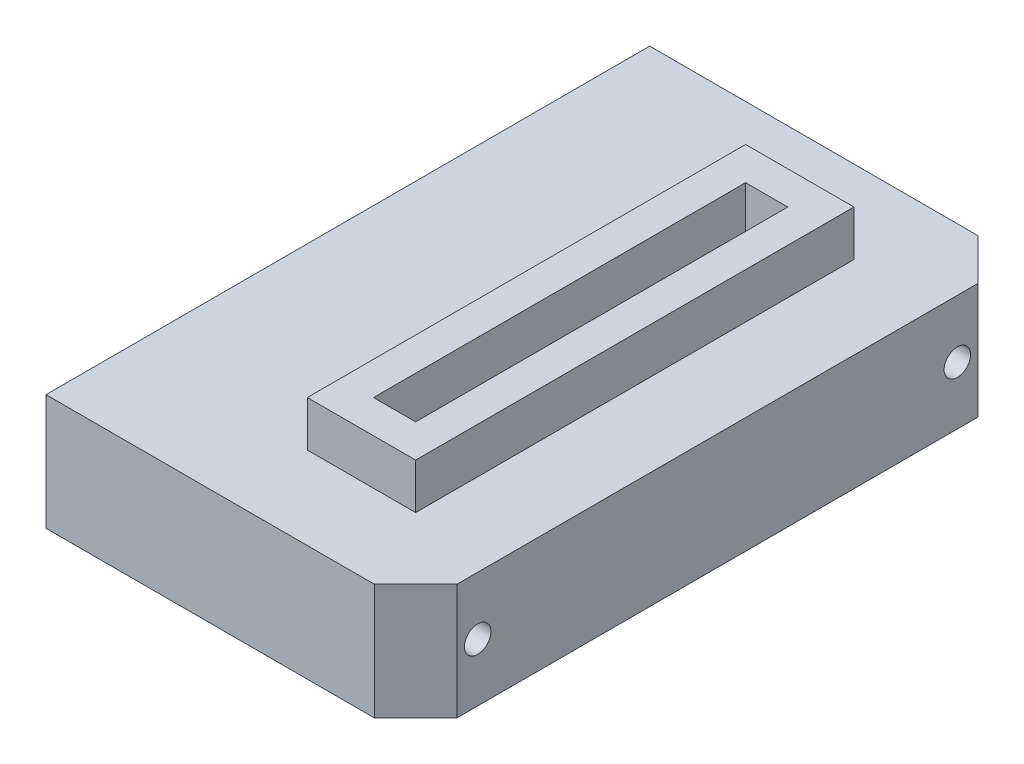
ISO-10303-21;
HEADER;
FILE_DESCRIPTION(('STEP AP214'),'2;1');
FILE_NAME('part.step','',(''),(''),'','','');
FILE_SCHEMA(('AUTOMOTIVE_DESIGN { 1 0 10303 214 1 1 1 1 }'));
ENDSEC;
DATA;
#1=APPLICATION_CONTEXT('core data for automotive mechanical design processes');
#2=APPLICATION_PROTOCOL_DEFINITION('international standard','automotive_design',2000,#1);
#3=PRODUCT_CONTEXT('',#1,'mechanical');
#4=PRODUCT('Part','Part','',(#3));
#5=PRODUCT_RELATED_PRODUCT_CATEGORY('part','',(#4));
#6=PRODUCT_DEFINITION_FORMATION('','',#4);
#7=PRODUCT_DEFINITION_CONTEXT('part definition',#1,'design');
#8=PRODUCT_DEFINITION('design','',#6,#7);
#9=PRODUCT_DEFINITION_SHAPE('','',#8);
#10=(LENGTH_UNIT() NAMED_UNIT(*) SI_UNIT(.MILLI.,.METRE.));
#11=(NAMED_UNIT(*) PLANE_ANGLE_UNIT() SI_UNIT($,.RADIAN.));
#12=(NAMED_UNIT(*) SI_UNIT($,.STERADIAN.) SOLID_ANGLE_UNIT());
#13=UNCERTAINTY_MEASURE_WITH_UNIT(LENGTH_MEASURE(1.E-05),#10,'distance_accuracy_value','');
#14=(GEOMETRIC_REPRESENTATION_CONTEXT(3) GLOBAL_UNCERTAINTY_ASSIGNED_CONTEXT((#13)) GLOBAL_UNIT_ASSIGNED_CONTEXT((#10,
#11,#12)) REPRESENTATION_CONTEXT('',''));
#15=CARTESIAN_POINT('',(0.,0.,0.));
#16=DIRECTION('',(0.,0.,1.));
#17=DIRECTION('',(1.,0.,0.));
#18=AXIS2_PLACEMENT_3D('',#15,#16,#17);
#19=CARTESIAN_POINT('',(0.,14.,0.));
#20=DIRECTION('',(0.,1.,0.));
#21=DIRECTION('',(0.,0.,1.));
#22=AXIS2_PLACEMENT_3D('',#19,#20,#21);
#23=PLANE('',#22);
#24=DIRECTION('',(0.707106781186548,0.,0.707106781186548));
#25=VECTOR('',#24,1.);
#26=CARTESIAN_POINT('',(17.6340668006405,14.,-27.9603055752748));
#27=LINE('',#26,#25);
#28=CARTESIAN_POINT('',(17.6340668006405,14.,-27.9603055752748));
#29=VERTEX_POINT('',#28);
#30=CARTESIAN_POINT('',(22.6340668006405,14.,-22.9603055752748));
#31=VERTEX_POINT('',#30);
#32=EDGE_CURVE('E139',#29,#31,#27,.T.);
#33=ORIENTED_EDGE('',*,*,#32,.F.);
#34=DIRECTION('',(-1.,0.,0.));
#35=VECTOR('',#34,1.);
#36=CARTESIAN_POINT('',(-22.0659331993595,14.,-27.9603055752748));
#37=LINE('',#36,#35);
#38=CARTESIAN_POINT('',(-22.0659331993595,14.,-27.9603055752748));
#39=VERTEX_POINT('',#38);
#40=EDGE_CURVE('E150',#29,#39,#37,.T.);
#41=ORIENTED_EDGE('',*,*,#40,.T.);
#42=DIRECTION('',(0.,0.,1.));
#43=VECTOR('',#42,1.);
#44=CARTESIAN_POINT('',(-22.0659331993595,14.,-27.9603055752748));
#45=LINE('',#44,#43);
#46=CARTESIAN_POINT('',(-22.0659331993595,14.,45.0396944247252));
#47=VERTEX_POINT('',#46);
#48=EDGE_CURVE('E175',#39,#47,#45,.T.);
#49=ORIENTED_EDGE('',*,*,#48,.T.);
#50=DIRECTION('',(1.,0.,0.));
#51=VECTOR('',#50,1.);
#52=CARTESIAN_POINT('',(-22.0659331993595,14.,45.0396944247252));
#53=LINE('',#52,#51);
#54=CARTESIAN_POINT('',(17.6340668006405,14.,45.0396944247252));
#55=VERTEX_POINT('',#54);
#56=EDGE_CURVE('E160',#47,#55,#53,.T.);
#57=ORIENTED_EDGE('',*,*,#56,.T.);
#58=DIRECTION('',(-0.707106781186548,0.,0.707106781186546));
#59=VECTOR('',#58,1.);
#60=CARTESIAN_POINT('',(17.6340668006405,14.,45.0396944247252));
#61=LINE('',#60,#59);
#62=CARTESIAN_POINT('',(22.6340668006405,14.,40.0396944247252));
#63=VERTEX_POINT('',#62);
#64=EDGE_CURVE('E258',#63,#55,#61,.T.);
#65=ORIENTED_EDGE('',*,*,#64,.F.);
#66=DIRECTION('',(0.,0.,-1.));
#67=VECTOR('',#66,1.);
#68=CARTESIAN_POINT('',(22.6340668006405,14.,-27.9603055752748));
#69=LINE('',#68,#67);
#70=EDGE_CURVE('E154',#63,#31,#69,.T.);
#71=ORIENTED_EDGE('',*,*,#70,.T.);
#72=EDGE_LOOP('',(#33,#41,#49,#57,#65,#71));
#73=FACE_BOUND('',#72,.T.);
#74=DIRECTION('',(1.,0.,0.));
#75=VECTOR('',#74,1.);
#76=CARTESIAN_POINT('',(-0.465933199359521,14.,35.0396944247252));
#77=LINE('',#76,#75);
#78=CARTESIAN_POINT('',(-0.465933199359521,14.,35.0396944247252));
#79=VERTEX_POINT('',#78);
#80=CARTESIAN_POINT('',(12.6340668006405,14.,35.0396944247252));
#81=VERTEX_POINT('',#80);
#82=EDGE_CURVE('E230',#79,#81,#77,.T.);
#83=ORIENTED_EDGE('',*,*,#82,.F.);
#84=DIRECTION('',(0.,0.,1.));
#85=VECTOR('',#84,1.);
#86=CARTESIAN_POINT('',(-0.465933199359527,14.,-17.9603055752748));
#87=LINE('',#86,#85);
#88=CARTESIAN_POINT('',(-0.465933199359527,14.,-17.9603055752748));
#89=VERTEX_POINT('',#88);
#90=EDGE_CURVE('E232',#89,#79,#87,.T.);
#91=ORIENTED_EDGE('',*,*,#90,.F.);
#92=DIRECTION('',(-1.,0.,0.));
#93=VECTOR('',#92,1.);
#94=CARTESIAN_POINT('',(-0.465933199359527,14.,-17.9603055752748));
#95=LINE('',#94,#93);
#96=CARTESIAN_POINT('',(12.6340668006405,14.,-17.9603055752748));
#97=VERTEX_POINT('',#96);
#98=EDGE_CURVE('E224',#97,#89,#95,.T.);
#99=ORIENTED_EDGE('',*,*,#98,.F.);
#100=DIRECTION('',(0.,0.,-1.));
#101=VECTOR('',#100,1.);
#102=CARTESIAN_POINT('',(12.6340668006405,14.,-17.9603055752748));
#103=LINE('',#102,#101);
#104=EDGE_CURVE('E227',#81,#97,#103,.T.);
#105=ORIENTED_EDGE('',*,*,#104,.F.);
#106=EDGE_LOOP('',(#83,#91,#99,#105));
#107=FACE_BOUND('',#106,.T.);
#108=ADVANCED_FACE('F38',(#73,#107),#23,.T.);
#109=CARTESIAN_POINT('',(0.,0.,0.));
#110=DIRECTION('',(0.,1.,0.));
#111=DIRECTION('',(0.,0.,1.));
#112=AXIS2_PLACEMENT_3D('',#109,#110,#111);
#113=PLANE('',#112);
#114=DIRECTION('',(-1.,0.,0.));
#115=VECTOR('',#114,1.);
#116=CARTESIAN_POINT('',(-22.0659331993595,0.,-27.9603055752748));
#117=LINE('',#116,#115);
#118=CARTESIAN_POINT('',(17.6340668006404,0.,-27.9603055752748));
#119=VERTEX_POINT('',#118);
#120=CARTESIAN_POINT('',(-22.0659331993595,0.,-27.9603055752748));
#121=VERTEX_POINT('',#120);
#122=EDGE_CURVE('E174',#119,#121,#117,.T.);
#123=ORIENTED_EDGE('',*,*,#122,.F.);
#124=DIRECTION('',(-0.707106781186548,0.,-0.707106781186548));
#125=VECTOR('',#124,1.);
#126=CARTESIAN_POINT('',(17.6340668006405,0.,-27.9603055752748));
#127=LINE('',#126,#125);
#128=CARTESIAN_POINT('',(22.6340668006405,0.,-22.9603055752748));
#129=VERTEX_POINT('',#128);
#130=EDGE_CURVE('E61',#129,#119,#127,.T.);
#131=ORIENTED_EDGE('',*,*,#130,.F.);
#132=DIRECTION('',(0.,0.,-1.));
#133=VECTOR('',#132,1.);
#134=CARTESIAN_POINT('',(22.6340668006405,0.,-27.9603055752748));
#135=LINE('',#134,#133);
#136=CARTESIAN_POINT('',(22.6340668006405,0.,40.0396944247252));
#137=VERTEX_POINT('',#136);
#138=EDGE_CURVE('E171',#137,#129,#135,.T.);
#139=ORIENTED_EDGE('',*,*,#138,.F.);
#140=DIRECTION('',(0.707106781186549,0.,-0.707106781186547));
#141=VECTOR('',#140,1.);
#142=CARTESIAN_POINT('',(17.6340668006405,0.,45.0396944247252));
#143=LINE('',#142,#141);
#144=CARTESIAN_POINT('',(17.6340668006405,0.,45.0396944247252));
#145=VERTEX_POINT('',#144);
#146=EDGE_CURVE('E53',#145,#137,#143,.T.);
#147=ORIENTED_EDGE('',*,*,#146,.F.);
#148=DIRECTION('',(1.,0.,0.));
#149=VECTOR('',#148,1.);
#150=CARTESIAN_POINT('',(-22.0659331993595,0.,45.0396944247252));
#151=LINE('',#150,#149);
#152=CARTESIAN_POINT('',(-22.0659331993595,0.,45.0396944247252));
#153=VERTEX_POINT('',#152);
#154=EDGE_CURVE('E167',#153,#145,#151,.T.);
#155=ORIENTED_EDGE('',*,*,#154,.F.);
#156=DIRECTION('',(0.,0.,1.));
#157=VECTOR('',#156,1.);
#158=CARTESIAN_POINT('',(-22.0659331993595,0.,-27.9603055752748));
#159=LINE('',#158,#157);
#160=EDGE_CURVE('E164',#121,#153,#159,.T.);
#161=ORIENTED_EDGE('',*,*,#160,.F.);
#162=EDGE_LOOP('',(#123,#131,#139,#147,#155,#161));
#163=FACE_BOUND('',#162,.T.);
#164=DIRECTION('',(0.,0.,1.));
#165=VECTOR('',#164,1.);
#166=CARTESIAN_POINT('',(3.53406680064047,0.,-13.9603055752748));
#167=LINE('',#166,#165);
#168=CARTESIAN_POINT('',(3.53406680064047,0.,-13.9603055752748));
#169=VERTEX_POINT('',#168);
#170=CARTESIAN_POINT('',(3.53406680064048,0.,31.0396944247252));
#171=VERTEX_POINT('',#170);
#172=EDGE_CURVE('E198',#169,#171,#167,.T.);
#173=ORIENTED_EDGE('',*,*,#172,.T.);
#174=DIRECTION('',(1.,0.,0.));
#175=VECTOR('',#174,1.);
#176=CARTESIAN_POINT('',(3.53406680064048,0.,31.0396944247252));
#177=LINE('',#176,#175);
#178=CARTESIAN_POINT('',(8.63406680064048,0.,31.0396944247252));
#179=VERTEX_POINT('',#178);
#180=EDGE_CURVE('E195',#171,#179,#177,.T.);
#181=ORIENTED_EDGE('',*,*,#180,.T.);
#182=DIRECTION('',(0.,0.,-1.));
#183=VECTOR('',#182,1.);
#184=CARTESIAN_POINT('',(8.63406680064047,0.,-13.9603055752748));
#185=LINE('',#184,#183);
#186=CARTESIAN_POINT('',(8.63406680064047,0.,-13.9603055752748));
#187=VERTEX_POINT('',#186);
#188=EDGE_CURVE('E192',#179,#187,#185,.T.);
#189=ORIENTED_EDGE('',*,*,#188,.T.);
#190=DIRECTION('',(-1.,0.,0.));
#191=VECTOR('',#190,1.);
#192=CARTESIAN_POINT('',(3.53406680064047,0.,-13.9603055752748));
#193=LINE('',#192,#191);
#194=EDGE_CURVE('E189',#187,#169,#193,.T.);
#195=ORIENTED_EDGE('',*,*,#194,.T.);
#196=EDGE_LOOP('',(#173,#181,#189,#195));
#197=FACE_BOUND('',#196,.T.);
#198=ADVANCED_FACE('F267',(#163,#197),#113,.F.);
#199=CARTESIAN_POINT('',(-22.0659331993595,14.,-27.9603055752748));
#200=DIRECTION('',(1.,0.,0.));
#201=DIRECTION('',(0.,0.,-1.));
#202=AXIS2_PLACEMENT_3D('',#199,#200,#201);
#203=PLANE('',#202);
#204=CARTESIAN_POINT('',(-22.0659331993595,7.,37.5396944247252));
#205=DIRECTION('',(1.,0.,0.));
#206=DIRECTION('',(0.,0.,-1.));
#207=AXIS2_PLACEMENT_3D('',#204,#205,#206);
#208=CIRCLE('',#207,1.6);
#209=CARTESIAN_POINT('',(-22.0659331993595,7.,35.9396944247252));
#210=VERTEX_POINT('',#209);
#211=EDGE_CURVE('E201',#210,#210,#208,.F.);
#212=ORIENTED_EDGE('',*,*,#211,.F.);
#213=EDGE_LOOP('',(#212));
#214=FACE_BOUND('',#213,.T.);
#215=CARTESIAN_POINT('',(-22.0659331993595,7.,-20.4603055752748));
#216=DIRECTION('',(1.,0.,0.));
#217=DIRECTION('',(0.,0.,-1.));
#218=AXIS2_PLACEMENT_3D('',#215,#216,#217);
#219=CIRCLE('',#218,1.6);
#220=CARTESIAN_POINT('',(-22.0659331993595,7.,-22.0603055752748));
#221=VERTEX_POINT('',#220);
#222=EDGE_CURVE('E202',#221,#221,#219,.F.);
#223=ORIENTED_EDGE('',*,*,#222,.F.);
#224=EDGE_LOOP('',(#223));
#225=FACE_BOUND('',#224,.T.);
#226=ORIENTED_EDGE('',*,*,#160,.T.);
#227=DIRECTION('',(0.,-1.,0.));
#228=VECTOR('',#227,1.);
#229=CARTESIAN_POINT('',(-22.0659331993595,14.,45.0396944247252));
#230=LINE('',#229,#228);
#231=EDGE_CURVE('E11',#47,#153,#230,.T.);
#232=ORIENTED_EDGE('',*,*,#231,.F.);
#233=ORIENTED_EDGE('',*,*,#48,.F.);
#234=DIRECTION('',(0.,-1.,0.));
#235=VECTOR('',#234,1.);
#236=CARTESIAN_POINT('',(-22.0659331993595,14.,-27.9603055752748));
#237=LINE('',#236,#235);
#238=EDGE_CURVE('E46',#39,#121,#237,.T.);
#239=ORIENTED_EDGE('',*,*,#238,.T.);
#240=EDGE_LOOP('',(#226,#232,#233,#239));
#241=FACE_BOUND('',#240,.T.);
#242=ADVANCED_FACE('F40',(#214,#225,#241),#203,.F.);
#243=CARTESIAN_POINT('',(-22.0659331993595,14.,45.0396944247252));
#244=DIRECTION('',(0.,0.,-1.));
#245=DIRECTION('',(-1.,0.,0.));
#246=AXIS2_PLACEMENT_3D('',#243,#244,#245);
#247=PLANE('',#246);
#248=ORIENTED_EDGE('',*,*,#154,.T.);
#249=DIRECTION('',(0.,1.,0.));
#250=VECTOR('',#249,1.);
#251=CARTESIAN_POINT('',(17.6340668006405,-0.000999999999999265,45.0396944247252));
#252=LINE('',#251,#250);
#253=EDGE_CURVE('E255',#145,#55,#252,.T.);
#254=ORIENTED_EDGE('',*,*,#253,.T.);
#255=ORIENTED_EDGE('',*,*,#56,.F.);
#256=ORIENTED_EDGE('',*,*,#231,.T.);
#257=EDGE_LOOP('',(#248,#254,#255,#256));
#258=FACE_BOUND('',#257,.T.);
#259=ADVANCED_FACE('F272',(#258),#247,.F.);
#260=CARTESIAN_POINT('',(22.6340668006405,14.,-27.9603055752748));
#261=DIRECTION('',(-1.,0.,0.));
#262=DIRECTION('',(0.,0.,1.));
#263=AXIS2_PLACEMENT_3D('',#260,#261,#262);
#264=PLANE('',#263);
#265=CARTESIAN_POINT('',(22.6340668006405,7.,37.5396944247252));
#266=DIRECTION('',(1.,0.,0.));
#267=DIRECTION('',(0.,0.,-1.));
#268=AXIS2_PLACEMENT_3D('',#265,#266,#267);
#269=CIRCLE('',#268,1.6);
#270=CARTESIAN_POINT('',(22.6340668006405,7.,35.9396944247252));
#271=VERTEX_POINT('',#270);
#272=EDGE_CURVE('E205',#271,#271,#269,.T.);
#273=ORIENTED_EDGE('',*,*,#272,.F.);
#274=EDGE_LOOP('',(#273));
#275=FACE_BOUND('',#274,.T.);
#276=CARTESIAN_POINT('',(22.6340668006405,7.,-20.4603055752748));
#277=DIRECTION('',(1.,0.,0.));
#278=DIRECTION('',(0.,0.,-1.));
#279=AXIS2_PLACEMENT_3D('',#276,#277,#278);
#280=CIRCLE('',#279,1.6);
#281=CARTESIAN_POINT('',(22.6340668006405,7.,-22.0603055752748));
#282=VERTEX_POINT('',#281);
#283=EDGE_CURVE('E206',#282,#282,#280,.T.);
#284=ORIENTED_EDGE('',*,*,#283,.F.);
#285=EDGE_LOOP('',(#284));
#286=FACE_BOUND('',#285,.T.);
#287=ORIENTED_EDGE('',*,*,#138,.T.);
#288=DIRECTION('',(0.,1.,0.));
#289=VECTOR('',#288,1.);
#290=CARTESIAN_POINT('',(22.6340668006405,-0.000999999999999265,-22.9603055752748));
#291=LINE('',#290,#289);
#292=EDGE_CURVE('E144',#129,#31,#291,.T.);
#293=ORIENTED_EDGE('',*,*,#292,.T.);
#294=ORIENTED_EDGE('',*,*,#70,.F.);
#295=DIRECTION('',(0.,1.,0.));
#296=VECTOR('',#295,1.);
#297=CARTESIAN_POINT('',(22.6340668006405,-0.000999999999999265,40.0396944247252));
#298=LINE('',#297,#296);
#299=EDGE_CURVE('E256',#137,#63,#298,.T.);
#300=ORIENTED_EDGE('',*,*,#299,.F.);
#301=EDGE_LOOP('',(#287,#293,#294,#300));
#302=FACE_BOUND('',#301,.T.);
#303=ADVANCED_FACE('F264',(#275,#286,#302),#264,.F.);
#304=CARTESIAN_POINT('',(-22.0659331993595,14.,-27.9603055752748));
#305=DIRECTION('',(0.,0.,1.));
#306=DIRECTION('',(1.,0.,0.));
#307=AXIS2_PLACEMENT_3D('',#304,#305,#306);
#308=PLANE('',#307);
#309=ORIENTED_EDGE('',*,*,#40,.F.);
#310=DIRECTION('',(0.,1.,0.));
#311=VECTOR('',#310,1.);
#312=CARTESIAN_POINT('',(17.6340668006405,-0.000999999999999265,-27.9603055752748));
#313=LINE('',#312,#311);
#314=EDGE_CURVE('E136',#119,#29,#313,.T.);
#315=ORIENTED_EDGE('',*,*,#314,.F.);
#316=ORIENTED_EDGE('',*,*,#122,.T.);
#317=ORIENTED_EDGE('',*,*,#238,.F.);
#318=EDGE_LOOP('',(#309,#315,#316,#317));
#319=FACE_BOUND('',#318,.T.);
#320=ADVANCED_FACE('F156',(#319),#308,.F.);
#321=CARTESIAN_POINT('',(3.53406680064047,14.,-13.9603055752748));
#322=DIRECTION('',(1.,0.,0.));
#323=DIRECTION('',(0.,0.,-1.));
#324=AXIS2_PLACEMENT_3D('',#321,#322,#323);
#325=PLANE('',#324);
#326=ORIENTED_EDGE('',*,*,#172,.F.);
#327=DIRECTION('',(0.,-1.,0.));
#328=VECTOR('',#327,1.);
#329=CARTESIAN_POINT('',(3.53406680064047,14.,-13.9603055752748));
#330=LINE('',#329,#328);
#331=CARTESIAN_POINT('',(3.53406680064047,19.5,-13.9603055752748));
#332=VERTEX_POINT('',#331);
#333=EDGE_CURVE('E186',#332,#169,#330,.T.);
#334=ORIENTED_EDGE('',*,*,#333,.F.);
#335=DIRECTION('',(0.,0.,1.));
#336=VECTOR('',#335,1.);
#337=CARTESIAN_POINT('',(3.53406680064047,19.5,-13.9603055752748));
#338=LINE('',#337,#336);
#339=CARTESIAN_POINT('',(3.53406680064047,19.5,31.0396944247252));
#340=VERTEX_POINT('',#339);
#341=EDGE_CURVE('E251',#332,#340,#338,.T.);
#342=ORIENTED_EDGE('',*,*,#341,.T.);
#343=DIRECTION('',(0.,-1.,0.));
#344=VECTOR('',#343,1.);
#345=CARTESIAN_POINT('',(3.53406680064048,14.,31.0396944247252));
#346=LINE('',#345,#344);
#347=EDGE_CURVE('E168',#340,#171,#346,.T.);
#348=ORIENTED_EDGE('',*,*,#347,.T.);
#349=EDGE_LOOP('',(#326,#334,#342,#348));
#350=FACE_BOUND('',#349,.T.);
#351=ADVANCED_FACE('F290',(#350),#325,.T.);
#352=CARTESIAN_POINT('',(3.53406680064048,14.,31.0396944247252));
#353=DIRECTION('',(0.,0.,-1.));
#354=DIRECTION('',(-1.,0.,0.));
#355=AXIS2_PLACEMENT_3D('',#352,#353,#354);
#356=PLANE('',#355);
#357=ORIENTED_EDGE('',*,*,#180,.F.);
#358=ORIENTED_EDGE('',*,*,#347,.F.);
#359=DIRECTION('',(1.,0.,0.));
#360=VECTOR('',#359,1.);
#361=CARTESIAN_POINT('',(3.53406680064047,19.5,31.0396944247252));
#362=LINE('',#361,#360);
#363=CARTESIAN_POINT('',(8.63406680064048,19.5,31.0396944247252));
#364=VERTEX_POINT('',#363);
#365=EDGE_CURVE('E248',#340,#364,#362,.T.);
#366=ORIENTED_EDGE('',*,*,#365,.T.);
#367=DIRECTION('',(0.,-1.,0.));
#368=VECTOR('',#367,1.);
#369=CARTESIAN_POINT('',(8.63406680064048,14.,31.0396944247252));
#370=LINE('',#369,#368);
#371=EDGE_CURVE('E182',#364,#179,#370,.T.);
#372=ORIENTED_EDGE('',*,*,#371,.T.);
#373=EDGE_LOOP('',(#357,#358,#366,#372));
#374=FACE_BOUND('',#373,.T.);
#375=ADVANCED_FACE('F328',(#374),#356,.T.);
#376=CARTESIAN_POINT('',(8.63406680064047,14.,-13.9603055752748));
#377=DIRECTION('',(-1.,0.,0.));
#378=DIRECTION('',(0.,0.,1.));
#379=AXIS2_PLACEMENT_3D('',#376,#377,#378);
#380=PLANE('',#379);
#381=ORIENTED_EDGE('',*,*,#188,.F.);
#382=ORIENTED_EDGE('',*,*,#371,.F.);
#383=DIRECTION('',(0.,0.,-1.));
#384=VECTOR('',#383,1.);
#385=CARTESIAN_POINT('',(8.63406680064048,19.5,-13.9603055752748));
#386=LINE('',#385,#384);
#387=CARTESIAN_POINT('',(8.63406680064048,19.5,-13.9603055752748));
#388=VERTEX_POINT('',#387);
#389=EDGE_CURVE('E245',#364,#388,#386,.T.);
#390=ORIENTED_EDGE('',*,*,#389,.T.);
#391=DIRECTION('',(0.,-1.,0.));
#392=VECTOR('',#391,1.);
#393=CARTESIAN_POINT('',(8.63406680064047,14.,-13.9603055752748));
#394=LINE('',#393,#392);
#395=EDGE_CURVE('E184',#388,#187,#394,.T.);
#396=ORIENTED_EDGE('',*,*,#395,.T.);
#397=EDGE_LOOP('',(#381,#382,#390,#396));
#398=FACE_BOUND('',#397,.T.);
#399=ADVANCED_FACE('F322',(#398),#380,.T.);
#400=CARTESIAN_POINT('',(3.53406680064047,14.,-13.9603055752748));
#401=DIRECTION('',(0.,0.,1.));
#402=DIRECTION('',(1.,0.,0.));
#403=AXIS2_PLACEMENT_3D('',#400,#401,#402);
#404=PLANE('',#403);
#405=ORIENTED_EDGE('',*,*,#194,.F.);
#406=ORIENTED_EDGE('',*,*,#395,.F.);
#407=DIRECTION('',(-1.,0.,0.));
#408=VECTOR('',#407,1.);
#409=CARTESIAN_POINT('',(3.53406680064047,19.5,-13.9603055752748));
#410=LINE('',#409,#408);
#411=EDGE_CURVE('E235',#388,#332,#410,.T.);
#412=ORIENTED_EDGE('',*,*,#411,.T.);
#413=ORIENTED_EDGE('',*,*,#333,.T.);
#414=EDGE_LOOP('',(#405,#406,#412,#413));
#415=FACE_BOUND('',#414,.T.);
#416=ADVANCED_FACE('F312',(#415),#404,.T.);
#417=CARTESIAN_POINT('',(-22.0669331993595,7.,-20.4603055752748));
#418=DIRECTION('',(1.,0.,0.));
#419=DIRECTION('',(0.,0.,-1.));
#420=AXIS2_PLACEMENT_3D('',#417,#418,#419);
#421=CYLINDRICAL_SURFACE('',#420,1.6);
#422=ORIENTED_EDGE('',*,*,#283,.T.);
#423=EDGE_LOOP('',(#422));
#424=FACE_BOUND('',#423,.T.);
#425=ORIENTED_EDGE('',*,*,#222,.T.);
#426=EDGE_LOOP('',(#425));
#427=FACE_BOUND('',#426,.T.);
#428=ADVANCED_FACE('F309',(#424,#427),#421,.F.);
#429=CARTESIAN_POINT('',(-22.0669331993595,7.,37.5396944247252));
#430=DIRECTION('',(1.,0.,0.));
#431=DIRECTION('',(0.,0.,-1.));
#432=AXIS2_PLACEMENT_3D('',#429,#430,#431);
#433=CYLINDRICAL_SURFACE('',#432,1.6);
#434=ORIENTED_EDGE('',*,*,#272,.T.);
#435=EDGE_LOOP('',(#434));
#436=FACE_BOUND('',#435,.T.);
#437=ORIENTED_EDGE('',*,*,#211,.T.);
#438=EDGE_LOOP('',(#437));
#439=FACE_BOUND('',#438,.T.);
#440=ADVANCED_FACE('F311',(#436,#439),#433,.F.);
#441=CARTESIAN_POINT('',(0.,19.5,0.));
#442=DIRECTION('',(0.,1.,0.));
#443=DIRECTION('',(0.,0.,1.));
#444=AXIS2_PLACEMENT_3D('',#441,#442,#443);
#445=PLANE('',#444);
#446=DIRECTION('',(0.,0.,1.));
#447=VECTOR('',#446,1.);
#448=CARTESIAN_POINT('',(-0.465933199359527,19.5,-17.9603055752748));
#449=LINE('',#448,#447);
#450=CARTESIAN_POINT('',(-0.465933199359527,19.5,-17.9603055752748));
#451=VERTEX_POINT('',#450);
#452=CARTESIAN_POINT('',(-0.465933199359521,19.5,35.0396944247252));
#453=VERTEX_POINT('',#452);
#454=EDGE_CURVE('E226',#451,#453,#449,.T.);
#455=ORIENTED_EDGE('',*,*,#454,.T.);
#456=DIRECTION('',(1.,0.,0.));
#457=VECTOR('',#456,1.);
#458=CARTESIAN_POINT('',(-0.465933199359521,19.5,35.0396944247252));
#459=LINE('',#458,#457);
#460=CARTESIAN_POINT('',(12.6340668006405,19.5,35.0396944247252));
#461=VERTEX_POINT('',#460);
#462=EDGE_CURVE('E239',#453,#461,#459,.T.);
#463=ORIENTED_EDGE('',*,*,#462,.T.);
#464=DIRECTION('',(0.,0.,-1.));
#465=VECTOR('',#464,1.);
#466=CARTESIAN_POINT('',(12.6340668006405,19.5,-17.9603055752748));
#467=LINE('',#466,#465);
#468=CARTESIAN_POINT('',(12.6340668006405,19.5,-17.9603055752748));
#469=VERTEX_POINT('',#468);
#470=EDGE_CURVE('E237',#461,#469,#467,.T.);
#471=ORIENTED_EDGE('',*,*,#470,.T.);
#472=DIRECTION('',(-1.,0.,0.));
#473=VECTOR('',#472,1.);
#474=CARTESIAN_POINT('',(-0.465933199359527,19.5,-17.9603055752748));
#475=LINE('',#474,#473);
#476=EDGE_CURVE('E223',#469,#451,#475,.T.);
#477=ORIENTED_EDGE('',*,*,#476,.T.);
#478=EDGE_LOOP('',(#455,#463,#471,#477));
#479=FACE_BOUND('',#478,.T.);
#480=ORIENTED_EDGE('',*,*,#365,.F.);
#481=ORIENTED_EDGE('',*,*,#341,.F.);
#482=ORIENTED_EDGE('',*,*,#411,.F.);
#483=ORIENTED_EDGE('',*,*,#389,.F.);
#484=EDGE_LOOP('',(#480,#481,#482,#483));
#485=FACE_BOUND('',#484,.T.);
#486=ADVANCED_FACE('F319',(#479,#485),#445,.T.);
#487=CARTESIAN_POINT('',(-0.465933199359527,19.5,-17.9603055752748));
#488=DIRECTION('',(1.,0.,0.));
#489=DIRECTION('',(0.,0.,-1.));
#490=AXIS2_PLACEMENT_3D('',#487,#488,#489);
#491=PLANE('',#490);
#492=ORIENTED_EDGE('',*,*,#90,.T.);
#493=DIRECTION('',(0.,-1.,0.));
#494=VECTOR('',#493,1.);
#495=CARTESIAN_POINT('',(-0.465933199359521,19.5,35.0396944247252));
#496=LINE('',#495,#494);
#497=EDGE_CURVE('E209',#453,#79,#496,.T.);
#498=ORIENTED_EDGE('',*,*,#497,.F.);
#499=ORIENTED_EDGE('',*,*,#454,.F.);
#500=DIRECTION('',(0.,-1.,0.));
#501=VECTOR('',#500,1.);
#502=CARTESIAN_POINT('',(-0.465933199359527,19.5,-17.9603055752748));
#503=LINE('',#502,#501);
#504=EDGE_CURVE('E220',#451,#89,#503,.T.);
#505=ORIENTED_EDGE('',*,*,#504,.T.);
#506=EDGE_LOOP('',(#492,#498,#499,#505));
#507=FACE_BOUND('',#506,.T.);
#508=ADVANCED_FACE('F344',(#507),#491,.F.);
#509=CARTESIAN_POINT('',(-0.465933199359521,19.5,35.0396944247252));
#510=DIRECTION('',(0.,0.,-1.));
#511=DIRECTION('',(-1.,0.,0.));
#512=AXIS2_PLACEMENT_3D('',#509,#510,#511);
#513=PLANE('',#512);
#514=ORIENTED_EDGE('',*,*,#82,.T.);
#515=DIRECTION('',(0.,-1.,0.));
#516=VECTOR('',#515,1.);
#517=CARTESIAN_POINT('',(12.6340668006405,19.5,35.0396944247252));
#518=LINE('',#517,#516);
#519=EDGE_CURVE('E215',#461,#81,#518,.T.);
#520=ORIENTED_EDGE('',*,*,#519,.F.);
#521=ORIENTED_EDGE('',*,*,#462,.F.);
#522=ORIENTED_EDGE('',*,*,#497,.T.);
#523=EDGE_LOOP('',(#514,#520,#521,#522));
#524=FACE_BOUND('',#523,.T.);
#525=ADVANCED_FACE('F349',(#524),#513,.F.);
#526=CARTESIAN_POINT('',(12.6340668006405,19.5,-17.9603055752748));
#527=DIRECTION('',(-1.,0.,0.));
#528=DIRECTION('',(0.,0.,1.));
#529=AXIS2_PLACEMENT_3D('',#526,#527,#528);
#530=PLANE('',#529);
#531=ORIENTED_EDGE('',*,*,#104,.T.);
#532=DIRECTION('',(0.,-1.,0.));
#533=VECTOR('',#532,1.);
#534=CARTESIAN_POINT('',(12.6340668006405,19.5,-17.9603055752748));
#535=LINE('',#534,#533);
#536=EDGE_CURVE('E218',#469,#97,#535,.T.);
#537=ORIENTED_EDGE('',*,*,#536,.F.);
#538=ORIENTED_EDGE('',*,*,#470,.F.);
#539=ORIENTED_EDGE('',*,*,#519,.T.);
#540=EDGE_LOOP('',(#531,#537,#538,#539));
#541=FACE_BOUND('',#540,.T.);
#542=ADVANCED_FACE('F354',(#541),#530,.F.);
#543=CARTESIAN_POINT('',(-0.465933199359527,19.5,-17.9603055752748));
#544=DIRECTION('',(0.,0.,1.));
#545=DIRECTION('',(1.,0.,0.));
#546=AXIS2_PLACEMENT_3D('',#543,#544,#545);
#547=PLANE('',#546);
#548=ORIENTED_EDGE('',*,*,#98,.T.);
#549=ORIENTED_EDGE('',*,*,#504,.F.);
#550=ORIENTED_EDGE('',*,*,#476,.F.);
#551=ORIENTED_EDGE('',*,*,#536,.T.);
#552=EDGE_LOOP('',(#548,#549,#550,#551));
#553=FACE_BOUND('',#552,.T.);
#554=ADVANCED_FACE('F279',(#553),#547,.F.);
#555=CARTESIAN_POINT('',(17.6340668006405,-0.000999999999999265,-27.9603055752748));
#556=DIRECTION('',(-0.707106781186547,0.,0.707106781186547));
#557=DIRECTION('',(0.707106781186548,0.,0.707106781186548));
#558=AXIS2_PLACEMENT_3D('',#555,#556,#557);
#559=PLANE('',#558);
#560=ORIENTED_EDGE('',*,*,#130,.T.);
#561=ORIENTED_EDGE('',*,*,#314,.T.);
#562=ORIENTED_EDGE('',*,*,#32,.T.);
#563=ORIENTED_EDGE('',*,*,#292,.F.);
#564=EDGE_LOOP('',(#560,#561,#562,#563));
#565=FACE_BOUND('',#564,.T.);
#566=ADVANCED_FACE('F138',(#565),#559,.F.);
#567=CARTESIAN_POINT('',(17.6340668006405,-0.000999999999999265,45.0396944247252));
#568=DIRECTION('',(-0.707106781186547,0.,-0.707106781186549));
#569=DIRECTION('',(-0.707106781186549,0.,0.707106781186547));
#570=AXIS2_PLACEMENT_3D('',#567,#568,#569);
#571=PLANE('',#570);
#572=ORIENTED_EDGE('',*,*,#146,.T.);
#573=ORIENTED_EDGE('',*,*,#299,.T.);
#574=ORIENTED_EDGE('',*,*,#64,.T.);
#575=ORIENTED_EDGE('',*,*,#253,.F.);
#576=EDGE_LOOP('',(#572,#573,#574,#575));
#577=FACE_BOUND('',#576,.T.);
#578=ADVANCED_FACE('F273',(#577),#571,.F.);
#579=CLOSED_SHELL('',(#108,#198,#242,#259,#303,#320,#351,#375,#399,#416,#428,#440,#486,#508,
#525,#542,#554,#566,#578));
#580=MANIFOLD_SOLID_BREP('B2',#579);
#581=ADVANCED_BREP_SHAPE_REPRESENTATION('',(#18,#580),#14);
#582=SHAPE_DEFINITION_REPRESENTATION(#9,#581);
ENDSEC;
END-ISO-10303-21;
